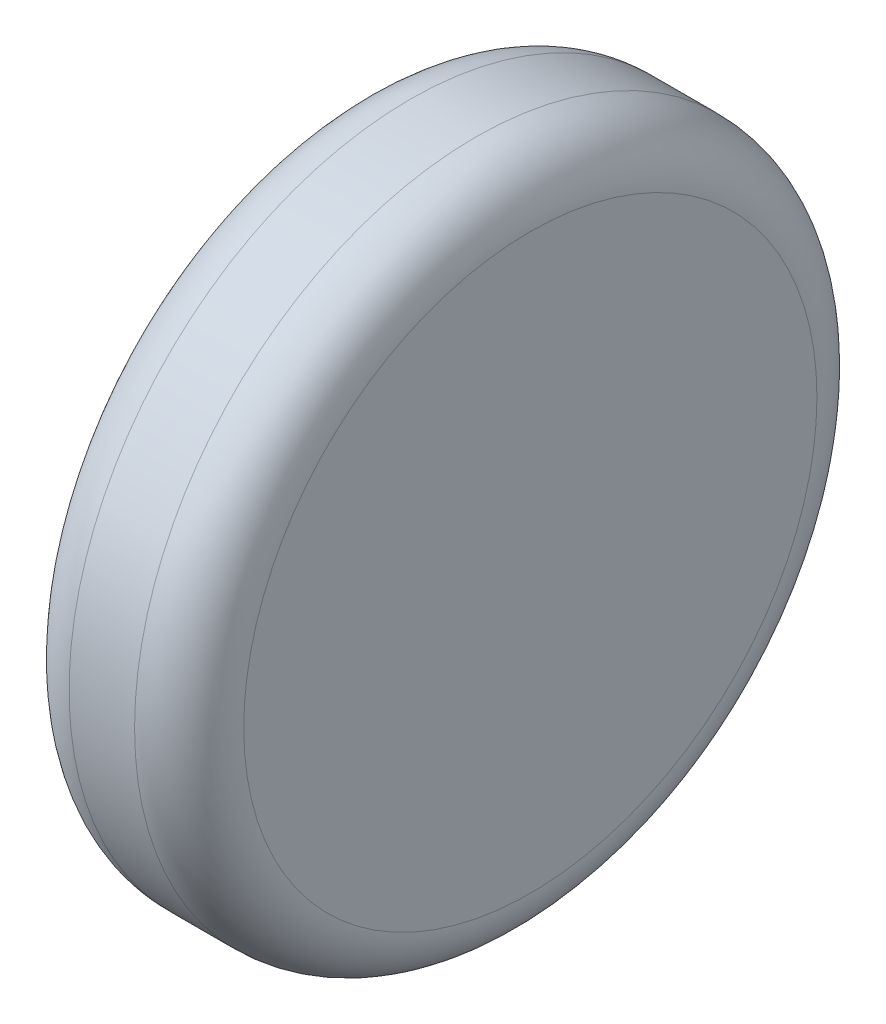
ISO-10303-21;
HEADER;
FILE_DESCRIPTION(('STEP AP214'),'2;1');
FILE_NAME('part.step','',(''),(''),'','','');
FILE_SCHEMA(('AUTOMOTIVE_DESIGN { 1 0 10303 214 1 1 1 1 }'));
ENDSEC;
DATA;
#1=APPLICATION_CONTEXT('core data for automotive mechanical design processes');
#2=APPLICATION_PROTOCOL_DEFINITION('international standard','automotive_design',2000,#1);
#3=PRODUCT_CONTEXT('',#1,'mechanical');
#4=PRODUCT('Part','Part','',(#3));
#5=PRODUCT_RELATED_PRODUCT_CATEGORY('part','',(#4));
#6=PRODUCT_DEFINITION_FORMATION('','',#4);
#7=PRODUCT_DEFINITION_CONTEXT('part definition',#1,'design');
#8=PRODUCT_DEFINITION('design','',#6,#7);
#9=PRODUCT_DEFINITION_SHAPE('','',#8);
#10=(LENGTH_UNIT() NAMED_UNIT(*) SI_UNIT(.MILLI.,.METRE.));
#11=(NAMED_UNIT(*) PLANE_ANGLE_UNIT() SI_UNIT($,.RADIAN.));
#12=(NAMED_UNIT(*) SI_UNIT($,.STERADIAN.) SOLID_ANGLE_UNIT());
#13=UNCERTAINTY_MEASURE_WITH_UNIT(LENGTH_MEASURE(1.E-05),#10,'distance_accuracy_value','');
#14=(GEOMETRIC_REPRESENTATION_CONTEXT(3) GLOBAL_UNCERTAINTY_ASSIGNED_CONTEXT((#13)) GLOBAL_UNIT_ASSIGNED_CONTEXT((#10,
#11,#12)) REPRESENTATION_CONTEXT('',''));
#15=CARTESIAN_POINT('',(0.,0.,0.));
#16=DIRECTION('',(0.,0.,1.));
#17=DIRECTION('',(1.,0.,0.));
#18=AXIS2_PLACEMENT_3D('',#15,#16,#17);
#19=CARTESIAN_POINT('',(-0.945364285309383,-0.332340218761648,0.1012));
#20=DIRECTION('',(1.,0.,0.));
#21=DIRECTION('',(0.,1.,0.));
#22=AXIS2_PLACEMENT_3D('',#19,#20,#21);
#23=PLANE('',#22);
#24=CARTESIAN_POINT('',(-0.945364285309383,-0.332340218761648,0.1012));
#25=DIRECTION('',(1.,0.,0.));
#26=DIRECTION('',(0.,0.,-1.));
#27=AXIS2_PLACEMENT_3D('',#24,#25,#26);
#28=CIRCLE('',#27,0.0262499999999999);
#29=CARTESIAN_POINT('',(-0.945364285309383,-0.332340218761648,0.0749500000000001));
#30=VERTEX_POINT('',#29);
#31=CARTESIAN_POINT('',(-0.945364285309383,-0.306090218761648,0.1012));
#32=VERTEX_POINT('',#31);
#33=EDGE_CURVE('E55',#30,#32,#28,.T.);
#34=ORIENTED_EDGE('',*,*,#33,.F.);
#35=CARTESIAN_POINT('',(-0.945364285309383,-0.332340218761648,0.1012));
#36=DIRECTION('',(1.,0.,0.));
#37=DIRECTION('',(0.,0.,1.));
#38=AXIS2_PLACEMENT_3D('',#35,#36,#37);
#39=CIRCLE('',#38,0.02625);
#40=CARTESIAN_POINT('',(-0.945364285309383,-0.332340218761648,0.12745));
#41=VERTEX_POINT('',#40);
#42=EDGE_CURVE('E49',#41,#30,#39,.T.);
#43=ORIENTED_EDGE('',*,*,#42,.F.);
#44=CARTESIAN_POINT('',(-0.945364285309383,-0.332340218761648,0.1012));
#45=DIRECTION('',(1.,0.,0.));
#46=DIRECTION('',(0.,1.,0.));
#47=AXIS2_PLACEMENT_3D('',#44,#45,#46);
#48=CIRCLE('',#47,0.02625);
#49=EDGE_CURVE('E53',#32,#41,#48,.T.);
#50=ORIENTED_EDGE('',*,*,#49,.F.);
#51=EDGE_LOOP('',(#34,#43,#50));
#52=FACE_BOUND('',#51,.T.);
#53=ADVANCED_FACE('F17',(#52),#23,.F.);
#54=CARTESIAN_POINT('',(-0.940364285309383,-0.332340218761648,0.1012));
#55=DIRECTION('',(1.,0.,0.));
#56=DIRECTION('',(0.,0.,1.));
#57=AXIS2_PLACEMENT_3D('',#54,#55,#56);
#58=TOROIDAL_SURFACE('',#57,0.02625,0.005);
#59=CARTESIAN_POINT('',(-0.940364285309383,-0.332340218761648,0.1012));
#60=DIRECTION('',(1.,0.,0.));
#61=DIRECTION('',(0.,1.,0.));
#62=AXIS2_PLACEMENT_3D('',#59,#60,#61);
#63=CIRCLE('',#62,0.03125);
#64=CARTESIAN_POINT('',(-0.940364285309383,-0.301090218761648,0.1012));
#65=VERTEX_POINT('',#64);
#66=EDGE_CURVE('E62',#65,#65,#63,.T.);
#67=ORIENTED_EDGE('',*,*,#66,.F.);
#68=EDGE_LOOP('',(#67));
#69=FACE_BOUND('',#68,.T.);
#70=ORIENTED_EDGE('',*,*,#33,.T.);
#71=ORIENTED_EDGE('',*,*,#49,.T.);
#72=ORIENTED_EDGE('',*,*,#42,.T.);
#73=EDGE_LOOP('',(#70,#71,#72));
#74=FACE_BOUND('',#73,.T.);
#75=ADVANCED_FACE('F60',(#69,#74),#58,.T.);
#76=CARTESIAN_POINT('',(-0.929364285309383,-0.332340218761648,0.1012));
#77=DIRECTION('',(1.,0.,0.));
#78=DIRECTION('',(0.,1.,0.));
#79=AXIS2_PLACEMENT_3D('',#76,#77,#78);
#80=CYLINDRICAL_SURFACE('',#79,0.03125);
#81=CARTESIAN_POINT('',(-0.934364285309383,-0.332340218761648,0.1012));
#82=DIRECTION('',(1.,0.,0.));
#83=DIRECTION('',(0.,0.,1.));
#84=AXIS2_PLACEMENT_3D('',#81,#82,#83);
#85=CIRCLE('',#84,0.03125);
#86=CARTESIAN_POINT('',(-0.934364285309383,-0.332340218761648,0.13245));
#87=VERTEX_POINT('',#86);
#88=EDGE_CURVE('E86',#87,#87,#85,.T.);
#89=ORIENTED_EDGE('',*,*,#88,.F.);
#90=EDGE_LOOP('',(#89));
#91=FACE_BOUND('',#90,.T.);
#92=ORIENTED_EDGE('',*,*,#66,.T.);
#93=EDGE_LOOP('',(#92));
#94=FACE_BOUND('',#93,.T.);
#95=ADVANCED_FACE('F79',(#91,#94),#80,.T.);
#96=CARTESIAN_POINT('',(-0.934364285309383,-0.332340218761648,0.1012));
#97=DIRECTION('',(1.,0.,0.));
#98=DIRECTION('',(0.,0.,1.));
#99=AXIS2_PLACEMENT_3D('',#96,#97,#98);
#100=TOROIDAL_SURFACE('',#99,0.02625,0.005);
#101=ORIENTED_EDGE('',*,*,#88,.T.);
#102=EDGE_LOOP('',(#101));
#103=FACE_BOUND('',#102,.T.);
#104=CARTESIAN_POINT('',(-0.929364285309383,-0.332340218761648,0.1012));
#105=DIRECTION('',(-1.,0.,0.));
#106=DIRECTION('',(0.,0.,-1.));
#107=AXIS2_PLACEMENT_3D('',#104,#105,#106);
#108=CIRCLE('',#107,0.0262499999999999);
#109=CARTESIAN_POINT('',(-0.929364285309383,-0.332340218761648,0.12745));
#110=VERTEX_POINT('',#109);
#111=CARTESIAN_POINT('',(-0.929364285309383,-0.332340218761648,0.0749500000000001));
#112=VERTEX_POINT('',#111);
#113=EDGE_CURVE('E11',#110,#112,#108,.F.);
#114=ORIENTED_EDGE('',*,*,#113,.F.);
#115=CARTESIAN_POINT('',(-0.929364285309383,-0.332340218761648,0.1012));
#116=DIRECTION('',(-1.,0.,0.));
#117=DIRECTION('',(0.,0.,1.));
#118=AXIS2_PLACEMENT_3D('',#115,#116,#117);
#119=CIRCLE('',#118,0.02625);
#120=CARTESIAN_POINT('',(-0.929364285309383,-0.306090218761648,0.1012));
#121=VERTEX_POINT('',#120);
#122=EDGE_CURVE('E28',#121,#110,#119,.F.);
#123=ORIENTED_EDGE('',*,*,#122,.F.);
#124=CARTESIAN_POINT('',(-0.929364285309383,-0.332340218761648,0.1012));
#125=DIRECTION('',(-1.,0.,0.));
#126=DIRECTION('',(0.,1.,0.));
#127=AXIS2_PLACEMENT_3D('',#124,#125,#126);
#128=CIRCLE('',#127,0.02625);
#129=EDGE_CURVE('E92',#112,#121,#128,.F.);
#130=ORIENTED_EDGE('',*,*,#129,.F.);
#131=EDGE_LOOP('',(#114,#123,#130));
#132=FACE_BOUND('',#131,.T.);
#133=ADVANCED_FACE('F117',(#103,#132),#100,.T.);
#134=CARTESIAN_POINT('',(-0.929364285309383,-0.332340218761648,0.1012));
#135=DIRECTION('',(1.,0.,0.));
#136=DIRECTION('',(0.,1.,0.));
#137=AXIS2_PLACEMENT_3D('',#134,#135,#136);
#138=PLANE('',#137);
#139=ORIENTED_EDGE('',*,*,#122,.T.);
#140=ORIENTED_EDGE('',*,*,#113,.T.);
#141=ORIENTED_EDGE('',*,*,#129,.T.);
#142=EDGE_LOOP('',(#139,#140,#141));
#143=FACE_BOUND('',#142,.T.);
#144=ADVANCED_FACE('F99',(#143),#138,.T.);
#145=CLOSED_SHELL('',(#53,#75,#95,#133,#144));
#146=MANIFOLD_SOLID_BREP('B1',#145);
#147=ADVANCED_BREP_SHAPE_REPRESENTATION('',(#18,#146),#14);
#148=SHAPE_DEFINITION_REPRESENTATION(#9,#147);
ENDSEC;
END-ISO-10303-21;
